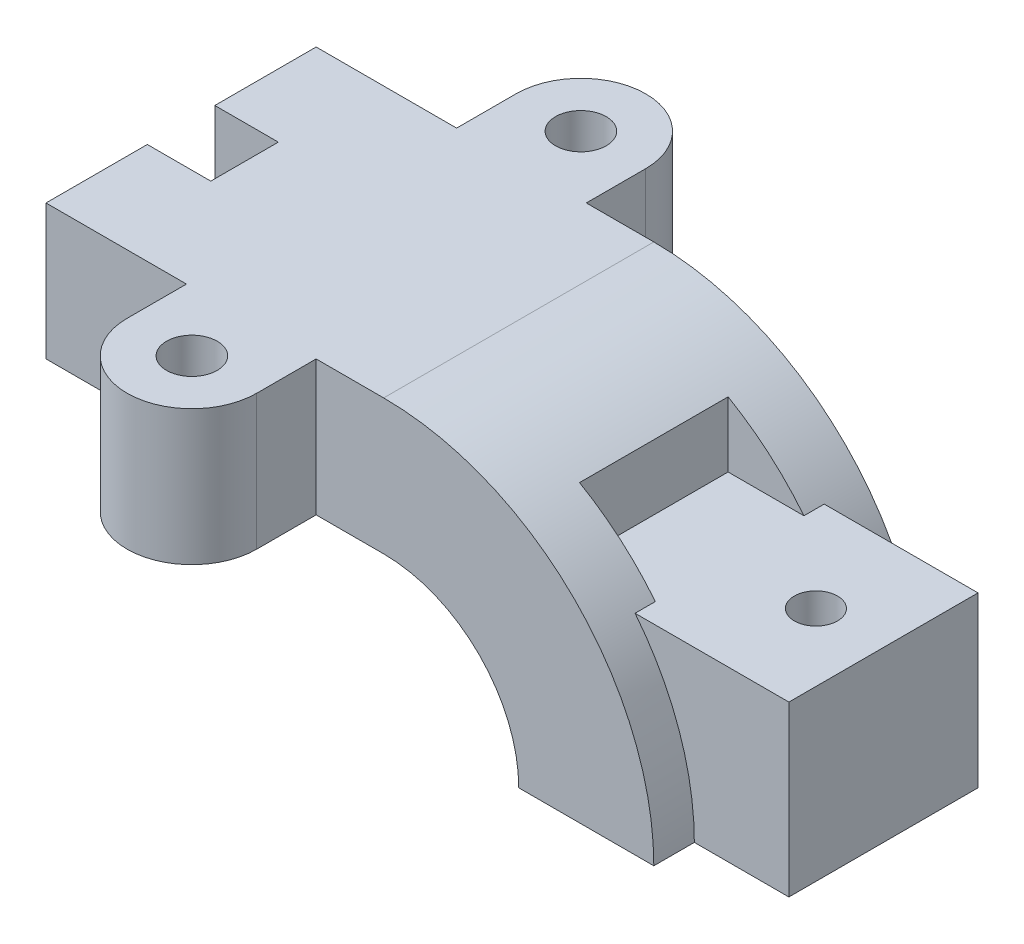
ISO-10303-21;
HEADER;
FILE_DESCRIPTION(('STEP AP214'),'2;1');
FILE_NAME('part.step','',(''),(''),'','','');
FILE_SCHEMA(('AUTOMOTIVE_DESIGN { 1 0 10303 214 1 1 1 1 }'));
ENDSEC;
DATA;
#1=APPLICATION_CONTEXT('core data for automotive mechanical design processes');
#2=APPLICATION_PROTOCOL_DEFINITION('international standard','automotive_design',2000,#1);
#3=PRODUCT_CONTEXT('',#1,'mechanical');
#4=PRODUCT('Part','Part','',(#3));
#5=PRODUCT_RELATED_PRODUCT_CATEGORY('part','',(#4));
#6=PRODUCT_DEFINITION_FORMATION('','',#4);
#7=PRODUCT_DEFINITION_CONTEXT('part definition',#1,'design');
#8=PRODUCT_DEFINITION('design','',#6,#7);
#9=PRODUCT_DEFINITION_SHAPE('','',#8);
#10=(LENGTH_UNIT() NAMED_UNIT(*) SI_UNIT(.MILLI.,.METRE.));
#11=(NAMED_UNIT(*) PLANE_ANGLE_UNIT() SI_UNIT($,.RADIAN.));
#12=(NAMED_UNIT(*) SI_UNIT($,.STERADIAN.) SOLID_ANGLE_UNIT());
#13=UNCERTAINTY_MEASURE_WITH_UNIT(LENGTH_MEASURE(1.E-05),#10,'distance_accuracy_value','');
#14=(GEOMETRIC_REPRESENTATION_CONTEXT(3) GLOBAL_UNCERTAINTY_ASSIGNED_CONTEXT((#13)) GLOBAL_UNIT_ASSIGNED_CONTEXT((#10,
#11,#12)) REPRESENTATION_CONTEXT('',''));
#15=CARTESIAN_POINT('',(0.,0.,0.));
#16=DIRECTION('',(0.,0.,1.));
#17=DIRECTION('',(1.,0.,0.));
#18=AXIS2_PLACEMENT_3D('',#15,#16,#17);
#19=CARTESIAN_POINT('',(0.,0.,-25.4));
#20=DIRECTION('',(0.,0.,-1.));
#21=DIRECTION('',(1.,0.,0.));
#22=AXIS2_PLACEMENT_3D('',#19,#20,#21);
#23=PLANE('',#22);
#24=DIRECTION('',(-1.,0.,0.));
#25=VECTOR('',#24,1.);
#26=CARTESIAN_POINT('',(0.,25.4,-25.4));
#27=LINE('',#26,#25);
#28=CARTESIAN_POINT('',(0.,25.4,-25.4));
#29=VERTEX_POINT('',#28);
#30=CARTESIAN_POINT('',(-12.7,25.4,-25.4));
#31=VERTEX_POINT('',#30);
#32=EDGE_CURVE('E61',#29,#31,#27,.T.);
#33=ORIENTED_EDGE('',*,*,#32,.T.);
#34=DIRECTION('',(0.,1.,0.));
#35=VECTOR('',#34,1.);
#36=CARTESIAN_POINT('',(-12.7,-8.37340492162435,-25.4));
#37=LINE('',#36,#35);
#38=CARTESIAN_POINT('',(-12.7,50.8,-25.4));
#39=VERTEX_POINT('',#38);
#40=EDGE_CURVE('E214',#31,#39,#37,.T.);
#41=ORIENTED_EDGE('',*,*,#40,.T.);
#42=DIRECTION('',(-1.,0.,0.));
#43=VECTOR('',#42,1.);
#44=CARTESIAN_POINT('',(0.,50.8,-25.4));
#45=LINE('',#44,#43);
#46=CARTESIAN_POINT('',(0.,50.8,-25.4));
#47=VERTEX_POINT('',#46);
#48=EDGE_CURVE('E312',#47,#39,#45,.T.);
#49=ORIENTED_EDGE('',*,*,#48,.F.);
#50=CARTESIAN_POINT('',(0.,0.,-25.4));
#51=DIRECTION('',(0.,0.,1.));
#52=DIRECTION('',(1.,0.,0.));
#53=AXIS2_PLACEMENT_3D('',#50,#51,#52);
#54=CIRCLE('',#53,50.8);
#55=CARTESIAN_POINT('',(50.8,0.,-25.4));
#56=VERTEX_POINT('',#55);
#57=EDGE_CURVE('E313',#56,#47,#54,.T.);
#58=ORIENTED_EDGE('',*,*,#57,.F.);
#59=DIRECTION('',(1.,0.,0.));
#60=VECTOR('',#59,1.);
#61=CARTESIAN_POINT('',(0.,0.,-25.4));
#62=LINE('',#61,#60);
#63=CARTESIAN_POINT('',(25.4,0.,-25.4));
#64=VERTEX_POINT('',#63);
#65=EDGE_CURVE('E532',#64,#56,#62,.T.);
#66=ORIENTED_EDGE('',*,*,#65,.F.);
#67=CARTESIAN_POINT('',(0.,0.,-25.4));
#68=DIRECTION('',(0.,0.,1.));
#69=DIRECTION('',(1.,0.,0.));
#70=AXIS2_PLACEMENT_3D('',#67,#68,#69);
#71=CIRCLE('',#70,25.4);
#72=EDGE_CURVE('E303',#64,#29,#71,.T.);
#73=ORIENTED_EDGE('',*,*,#72,.T.);
#74=EDGE_LOOP('',(#33,#41,#49,#58,#66,#73));
#75=FACE_BOUND('',#74,.T.);
#76=ADVANCED_FACE('F36',(#75),#23,.T.);
#77=CARTESIAN_POINT('',(0.,0.,25.4));
#78=DIRECTION('',(0.,0.,1.));
#79=DIRECTION('',(1.,0.,0.));
#80=AXIS2_PLACEMENT_3D('',#77,#78,#79);
#81=PLANE('',#80);
#82=DIRECTION('',(-1.,0.,0.));
#83=VECTOR('',#82,1.);
#84=CARTESIAN_POINT('',(0.,25.4,25.4));
#85=LINE('',#84,#83);
#86=CARTESIAN_POINT('',(-37.084,25.4,25.4));
#87=VERTEX_POINT('',#86);
#88=CARTESIAN_POINT('',(-63.5,25.4,25.4));
#89=VERTEX_POINT('',#88);
#90=EDGE_CURVE('E348',#87,#89,#85,.T.);
#91=ORIENTED_EDGE('',*,*,#90,.F.);
#92=DIRECTION('',(0.,1.,0.));
#93=VECTOR('',#92,1.);
#94=CARTESIAN_POINT('',(-37.084,-8.37340492162435,25.4));
#95=LINE('',#94,#93);
#96=CARTESIAN_POINT('',(-37.084,50.8,25.4));
#97=VERTEX_POINT('',#96);
#98=EDGE_CURVE('E266',#87,#97,#95,.T.);
#99=ORIENTED_EDGE('',*,*,#98,.T.);
#100=DIRECTION('',(-1.,0.,0.));
#101=VECTOR('',#100,1.);
#102=CARTESIAN_POINT('',(0.,50.8,25.4));
#103=LINE('',#102,#101);
#104=CARTESIAN_POINT('',(-63.5,50.8,25.4));
#105=VERTEX_POINT('',#104);
#106=EDGE_CURVE('E277',#97,#105,#103,.T.);
#107=ORIENTED_EDGE('',*,*,#106,.T.);
#108=DIRECTION('',(0.,1.,0.));
#109=VECTOR('',#108,1.);
#110=CARTESIAN_POINT('',(-63.5,0.,25.4));
#111=LINE('',#110,#109);
#112=EDGE_CURVE('E345',#89,#105,#111,.T.);
#113=ORIENTED_EDGE('',*,*,#112,.F.);
#114=EDGE_LOOP('',(#91,#99,#107,#113));
#115=FACE_BOUND('',#114,.T.);
#116=ADVANCED_FACE('F575',(#115),#81,.T.);
#117=CARTESIAN_POINT('',(0.,0.,6.35));
#118=DIRECTION('',(0.,0.,-1.));
#119=DIRECTION('',(-1.,0.,0.));
#120=AXIS2_PLACEMENT_3D('',#117,#118,#119);
#121=CYLINDRICAL_SURFACE('',#120,25.4);
#122=DIRECTION('',(0.,0.,-1.));
#123=VECTOR('',#122,1.);
#124=CARTESIAN_POINT('',(0.,25.4,6.35));
#125=LINE('',#124,#123);
#126=CARTESIAN_POINT('',(0.,25.4,25.4));
#127=VERTEX_POINT('',#126);
#128=EDGE_CURVE('E431',#127,#29,#125,.T.);
#129=ORIENTED_EDGE('',*,*,#128,.T.);
#130=ORIENTED_EDGE('',*,*,#72,.F.);
#131=DIRECTION('',(0.,0.,-1.));
#132=VECTOR('',#131,1.);
#133=CARTESIAN_POINT('',(25.4,0.,6.35));
#134=LINE('',#133,#132);
#135=CARTESIAN_POINT('',(25.4,0.,25.4));
#136=VERTEX_POINT('',#135);
#137=EDGE_CURVE('E11',#136,#64,#134,.T.);
#138=ORIENTED_EDGE('',*,*,#137,.F.);
#139=CARTESIAN_POINT('',(0.,0.,25.4));
#140=DIRECTION('',(0.,0.,1.));
#141=DIRECTION('',(1.,0.,0.));
#142=AXIS2_PLACEMENT_3D('',#139,#140,#141);
#143=CIRCLE('',#142,25.4);
#144=EDGE_CURVE('E352',#136,#127,#143,.T.);
#145=ORIENTED_EDGE('',*,*,#144,.T.);
#146=EDGE_LOOP('',(#129,#130,#138,#145));
#147=FACE_BOUND('',#146,.T.);
#148=ADVANCED_FACE('F38',(#147),#121,.F.);
#149=CARTESIAN_POINT('',(0.,0.,6.35));
#150=DIRECTION('',(0.,1.,0.));
#151=DIRECTION('',(0.,0.,1.));
#152=AXIS2_PLACEMENT_3D('',#149,#150,#151);
#153=PLANE('',#152);
#154=CARTESIAN_POINT('',(55.88,0.,0.));
#155=DIRECTION('',(0.,1.,0.));
#156=DIRECTION('',(0.,0.,1.));
#157=AXIS2_PLACEMENT_3D('',#154,#155,#156);
#158=CIRCLE('',#157,4.064);
#159=CARTESIAN_POINT('',(55.88,0.,4.064));
#160=VERTEX_POINT('',#159);
#161=EDGE_CURVE('E247',#160,#160,#158,.T.);
#162=ORIENTED_EDGE('',*,*,#161,.T.);
#163=EDGE_LOOP('',(#162));
#164=FACE_BOUND('',#163,.T.);
#165=ORIENTED_EDGE('',*,*,#137,.T.);
#166=ORIENTED_EDGE('',*,*,#65,.T.);
#167=DIRECTION('',(0.,0.,1.));
#168=VECTOR('',#167,1.);
#169=CARTESIAN_POINT('',(50.8,0.,-25.4));
#170=LINE('',#169,#168);
#171=CARTESIAN_POINT('',(50.8,0.,-17.78));
#172=VERTEX_POINT('',#171);
#173=EDGE_CURVE('E340',#56,#172,#170,.T.);
#174=ORIENTED_EDGE('',*,*,#173,.T.);
#175=DIRECTION('',(1.,0.,0.));
#176=VECTOR('',#175,1.);
#177=CARTESIAN_POINT('',(0.,0.,-17.78));
#178=LINE('',#177,#176);
#179=CARTESIAN_POINT('',(68.58,0.,-17.78));
#180=VERTEX_POINT('',#179);
#181=EDGE_CURVE('E327',#172,#180,#178,.T.);
#182=ORIENTED_EDGE('',*,*,#181,.T.);
#183=DIRECTION('',(0.,0.,-1.));
#184=VECTOR('',#183,1.);
#185=CARTESIAN_POINT('',(68.58,0.,6.35));
#186=LINE('',#185,#184);
#187=CARTESIAN_POINT('',(68.58,0.,17.78));
#188=VERTEX_POINT('',#187);
#189=EDGE_CURVE('E45',#188,#180,#186,.T.);
#190=ORIENTED_EDGE('',*,*,#189,.F.);
#191=DIRECTION('',(1.,0.,0.));
#192=VECTOR('',#191,1.);
#193=CARTESIAN_POINT('',(0.,0.,17.78));
#194=LINE('',#193,#192);
#195=CARTESIAN_POINT('',(50.8,0.,17.78));
#196=VERTEX_POINT('',#195);
#197=EDGE_CURVE('E373',#196,#188,#194,.T.);
#198=ORIENTED_EDGE('',*,*,#197,.F.);
#199=DIRECTION('',(0.,0.,-1.));
#200=VECTOR('',#199,1.);
#201=CARTESIAN_POINT('',(50.8,0.,25.4));
#202=LINE('',#201,#200);
#203=CARTESIAN_POINT('',(50.8,0.,25.4));
#204=VERTEX_POINT('',#203);
#205=EDGE_CURVE('E362',#204,#196,#202,.T.);
#206=ORIENTED_EDGE('',*,*,#205,.F.);
#207=DIRECTION('',(1.,0.,0.));
#208=VECTOR('',#207,1.);
#209=CARTESIAN_POINT('',(0.,0.,25.4));
#210=LINE('',#209,#208);
#211=EDGE_CURVE('E552',#136,#204,#210,.T.);
#212=ORIENTED_EDGE('',*,*,#211,.F.);
#213=EDGE_LOOP('',(#165,#166,#174,#182,#190,#198,#206,#212));
#214=FACE_BOUND('',#213,.T.);
#215=ADVANCED_FACE('F516',(#164,#214),#153,.F.);
#216=CARTESIAN_POINT('',(68.58,0.,6.35));
#217=DIRECTION('',(-1.,0.,0.));
#218=DIRECTION('',(0.,0.,1.));
#219=AXIS2_PLACEMENT_3D('',#216,#217,#218);
#220=PLANE('',#219);
#221=ORIENTED_EDGE('',*,*,#189,.T.);
#222=DIRECTION('',(0.,1.,0.));
#223=VECTOR('',#222,1.);
#224=CARTESIAN_POINT('',(68.58,0.,-17.78));
#225=LINE('',#224,#223);
#226=CARTESIAN_POINT('',(68.58,31.75,-17.78));
#227=VERTEX_POINT('',#226);
#228=EDGE_CURVE('E324',#180,#227,#225,.T.);
#229=ORIENTED_EDGE('',*,*,#228,.T.);
#230=DIRECTION('',(0.,0.,-1.));
#231=VECTOR('',#230,1.);
#232=CARTESIAN_POINT('',(68.58,31.75,6.35));
#233=LINE('',#232,#231);
#234=CARTESIAN_POINT('',(68.58,31.75,17.78));
#235=VERTEX_POINT('',#234);
#236=EDGE_CURVE('E451',#235,#227,#233,.T.);
#237=ORIENTED_EDGE('',*,*,#236,.F.);
#238=DIRECTION('',(0.,1.,0.));
#239=VECTOR('',#238,1.);
#240=CARTESIAN_POINT('',(68.58,0.,17.78));
#241=LINE('',#240,#239);
#242=EDGE_CURVE('E372',#188,#235,#241,.T.);
#243=ORIENTED_EDGE('',*,*,#242,.F.);
#244=EDGE_LOOP('',(#221,#229,#237,#243));
#245=FACE_BOUND('',#244,.T.);
#246=ADVANCED_FACE('F523',(#245),#220,.F.);
#247=CARTESIAN_POINT('',(0.,31.75,6.35));
#248=DIRECTION('',(0.,-1.,0.));
#249=DIRECTION('',(1.,0.,0.));
#250=AXIS2_PLACEMENT_3D('',#247,#248,#249);
#251=PLANE('',#250);
#252=CARTESIAN_POINT('',(55.88,31.75,0.));
#253=DIRECTION('',(0.,1.,0.));
#254=DIRECTION('',(-1.,0.,0.));
#255=AXIS2_PLACEMENT_3D('',#252,#253,#254);
#256=CIRCLE('',#255,4.064);
#257=CARTESIAN_POINT('',(51.816,31.75,0.));
#258=VERTEX_POINT('',#257);
#259=EDGE_CURVE('E250',#258,#258,#256,.T.);
#260=ORIENTED_EDGE('',*,*,#259,.F.);
#261=EDGE_LOOP('',(#260));
#262=FACE_BOUND('',#261,.T.);
#263=ORIENTED_EDGE('',*,*,#236,.T.);
#264=DIRECTION('',(-1.,0.,0.));
#265=VECTOR('',#264,1.);
#266=CARTESIAN_POINT('',(0.,31.75,-17.78));
#267=LINE('',#266,#265);
#268=CARTESIAN_POINT('',(39.6557372898298,31.75,-17.78));
#269=VERTEX_POINT('',#268);
#270=EDGE_CURVE('E334',#227,#269,#267,.T.);
#271=ORIENTED_EDGE('',*,*,#270,.T.);
#272=DIRECTION('',(0.,0.,1.));
#273=VECTOR('',#272,1.);
#274=CARTESIAN_POINT('',(39.6557372898298,31.75,-17.78));
#275=LINE('',#274,#273);
#276=CARTESIAN_POINT('',(39.6557372898298,31.75,-13.97));
#277=VERTEX_POINT('',#276);
#278=EDGE_CURVE('E337',#269,#277,#275,.T.);
#279=ORIENTED_EDGE('',*,*,#278,.T.);
#280=DIRECTION('',(-1.,0.,0.));
#281=VECTOR('',#280,1.);
#282=CARTESIAN_POINT('',(0.,31.75,-13.97));
#283=LINE('',#282,#281);
#284=CARTESIAN_POINT('',(25.4,31.75,-13.97));
#285=VERTEX_POINT('',#284);
#286=EDGE_CURVE('E465',#277,#285,#283,.T.);
#287=ORIENTED_EDGE('',*,*,#286,.T.);
#288=DIRECTION('',(0.,0.,-1.));
#289=VECTOR('',#288,1.);
#290=CARTESIAN_POINT('',(25.4,31.75,6.35));
#291=LINE('',#290,#289);
#292=CARTESIAN_POINT('',(25.4,31.75,13.97));
#293=VERTEX_POINT('',#292);
#294=EDGE_CURVE('E403',#293,#285,#291,.T.);
#295=ORIENTED_EDGE('',*,*,#294,.F.);
#296=DIRECTION('',(-1.,0.,0.));
#297=VECTOR('',#296,1.);
#298=CARTESIAN_POINT('',(0.,31.75,13.97));
#299=LINE('',#298,#297);
#300=CARTESIAN_POINT('',(39.6557372898298,31.75,13.97));
#301=VERTEX_POINT('',#300);
#302=EDGE_CURVE('E393',#301,#293,#299,.T.);
#303=ORIENTED_EDGE('',*,*,#302,.F.);
#304=DIRECTION('',(0.,0.,-1.));
#305=VECTOR('',#304,1.);
#306=CARTESIAN_POINT('',(39.6557372898298,31.75,17.78));
#307=LINE('',#306,#305);
#308=CARTESIAN_POINT('',(39.6557372898298,31.75,17.78));
#309=VERTEX_POINT('',#308);
#310=EDGE_CURVE('E371',#309,#301,#307,.T.);
#311=ORIENTED_EDGE('',*,*,#310,.F.);
#312=DIRECTION('',(-1.,0.,0.));
#313=VECTOR('',#312,1.);
#314=CARTESIAN_POINT('',(0.,31.75,17.78));
#315=LINE('',#314,#313);
#316=EDGE_CURVE('E369',#235,#309,#315,.T.);
#317=ORIENTED_EDGE('',*,*,#316,.F.);
#318=EDGE_LOOP('',(#263,#271,#279,#287,#295,#303,#311,#317));
#319=FACE_BOUND('',#318,.T.);
#320=ADVANCED_FACE('F469',(#262,#319),#251,.F.);
#321=CARTESIAN_POINT('',(25.4,0.,6.35));
#322=DIRECTION('',(-1.,0.,0.));
#323=DIRECTION('',(0.,0.,1.));
#324=AXIS2_PLACEMENT_3D('',#321,#322,#323);
#325=PLANE('',#324);
#326=ORIENTED_EDGE('',*,*,#294,.T.);
#327=DIRECTION('',(0.,1.,0.));
#328=VECTOR('',#327,1.);
#329=CARTESIAN_POINT('',(25.4,0.,-13.97));
#330=LINE('',#329,#328);
#331=CARTESIAN_POINT('',(25.4,43.9940905122495,-13.97));
#332=VERTEX_POINT('',#331);
#333=EDGE_CURVE('E458',#285,#332,#330,.T.);
#334=ORIENTED_EDGE('',*,*,#333,.T.);
#335=DIRECTION('',(0.,0.,-1.));
#336=VECTOR('',#335,1.);
#337=CARTESIAN_POINT('',(25.4,43.9940905122495,6.35));
#338=LINE('',#337,#336);
#339=CARTESIAN_POINT('',(25.4,43.9940905122495,13.97));
#340=VERTEX_POINT('',#339);
#341=EDGE_CURVE('E401',#340,#332,#338,.T.);
#342=ORIENTED_EDGE('',*,*,#341,.F.);
#343=DIRECTION('',(0.,1.,0.));
#344=VECTOR('',#343,1.);
#345=CARTESIAN_POINT('',(25.4,0.,13.97));
#346=LINE('',#345,#344);
#347=EDGE_CURVE('E397',#293,#340,#346,.T.);
#348=ORIENTED_EDGE('',*,*,#347,.F.);
#349=EDGE_LOOP('',(#326,#334,#342,#348));
#350=FACE_BOUND('',#349,.T.);
#351=ADVANCED_FACE('F457',(#350),#325,.F.);
#352=CARTESIAN_POINT('',(0.,0.,6.35));
#353=DIRECTION('',(0.,0.,-1.));
#354=DIRECTION('',(-1.,0.,0.));
#355=AXIS2_PLACEMENT_3D('',#352,#353,#354);
#356=CYLINDRICAL_SURFACE('',#355,50.8);
#357=ORIENTED_EDGE('',*,*,#341,.T.);
#358=CARTESIAN_POINT('',(0.,0.,-13.97));
#359=DIRECTION('',(0.,0.,1.));
#360=DIRECTION('',(1.,0.,0.));
#361=AXIS2_PLACEMENT_3D('',#358,#359,#360);
#362=CIRCLE('',#361,50.8);
#363=EDGE_CURVE('E331',#277,#332,#362,.T.);
#364=ORIENTED_EDGE('',*,*,#363,.F.);
#365=ORIENTED_EDGE('',*,*,#278,.F.);
#366=CARTESIAN_POINT('',(0.,0.,-17.78));
#367=DIRECTION('',(0.,0.,1.));
#368=DIRECTION('',(1.,0.,0.));
#369=AXIS2_PLACEMENT_3D('',#366,#367,#368);
#370=CIRCLE('',#369,50.8);
#371=EDGE_CURVE('E276',#172,#269,#370,.T.);
#372=ORIENTED_EDGE('',*,*,#371,.F.);
#373=ORIENTED_EDGE('',*,*,#173,.F.);
#374=ORIENTED_EDGE('',*,*,#57,.T.);
#375=DIRECTION('',(0.,0.,-1.));
#376=VECTOR('',#375,1.);
#377=CARTESIAN_POINT('',(0.,50.8,6.35));
#378=LINE('',#377,#376);
#379=CARTESIAN_POINT('',(0.,50.8,25.4));
#380=VERTEX_POINT('',#379);
#381=EDGE_CURVE('E404',#380,#47,#378,.T.);
#382=ORIENTED_EDGE('',*,*,#381,.F.);
#383=CARTESIAN_POINT('',(0.,0.,25.4));
#384=DIRECTION('',(0.,0.,1.));
#385=DIRECTION('',(1.,0.,0.));
#386=AXIS2_PLACEMENT_3D('',#383,#384,#385);
#387=CIRCLE('',#386,50.8);
#388=EDGE_CURVE('E547',#204,#380,#387,.T.);
#389=ORIENTED_EDGE('',*,*,#388,.F.);
#390=ORIENTED_EDGE('',*,*,#205,.T.);
#391=CARTESIAN_POINT('',(0.,0.,17.78));
#392=DIRECTION('',(0.,0.,1.));
#393=DIRECTION('',(1.,0.,0.));
#394=AXIS2_PLACEMENT_3D('',#391,#392,#393);
#395=CIRCLE('',#394,50.8);
#396=EDGE_CURVE('E349',#196,#309,#395,.T.);
#397=ORIENTED_EDGE('',*,*,#396,.T.);
#398=ORIENTED_EDGE('',*,*,#310,.T.);
#399=CARTESIAN_POINT('',(0.,0.,13.97));
#400=DIRECTION('',(0.,0.,1.));
#401=DIRECTION('',(1.,0.,0.));
#402=AXIS2_PLACEMENT_3D('',#399,#400,#401);
#403=CIRCLE('',#402,50.8);
#404=EDGE_CURVE('E365',#301,#340,#403,.T.);
#405=ORIENTED_EDGE('',*,*,#404,.T.);
#406=EDGE_LOOP('',(#357,#364,#365,#372,#373,#374,#382,#389,#390,#397,#398,#405));
#407=FACE_BOUND('',#406,.T.);
#408=ADVANCED_FACE('F507',(#407),#356,.T.);
#409=CARTESIAN_POINT('',(0.,50.8,6.35));
#410=DIRECTION('',(0.,-1.,0.));
#411=DIRECTION('',(1.,0.,0.));
#412=AXIS2_PLACEMENT_3D('',#409,#410,#411);
#413=PLANE('',#412);
#414=ORIENTED_EDGE('',*,*,#381,.T.);
#415=ORIENTED_EDGE('',*,*,#48,.T.);
#416=DIRECTION('',(0.,0.,1.));
#417=VECTOR('',#416,1.);
#418=CARTESIAN_POINT('',(-12.7,50.8,0.));
#419=LINE('',#418,#417);
#420=CARTESIAN_POINT('',(-12.7,50.8,-36.576));
#421=VERTEX_POINT('',#420);
#422=EDGE_CURVE('E240',#421,#39,#419,.T.);
#423=ORIENTED_EDGE('',*,*,#422,.F.);
#424=CARTESIAN_POINT('',(-24.892,50.8,-36.576));
#425=DIRECTION('',(0.,1.,0.));
#426=DIRECTION('',(-1.,0.,0.));
#427=AXIS2_PLACEMENT_3D('',#424,#425,#426);
#428=CIRCLE('',#427,12.192);
#429=CARTESIAN_POINT('',(-37.084,50.8,-36.576));
#430=VERTEX_POINT('',#429);
#431=EDGE_CURVE('E979',#421,#430,#428,.T.);
#432=ORIENTED_EDGE('',*,*,#431,.T.);
#433=DIRECTION('',(0.,0.,1.));
#434=VECTOR('',#433,1.);
#435=CARTESIAN_POINT('',(-37.084,50.8,0.));
#436=LINE('',#435,#434);
#437=CARTESIAN_POINT('',(-37.084,50.8,-25.4));
#438=VERTEX_POINT('',#437);
#439=EDGE_CURVE('E220',#430,#438,#436,.T.);
#440=ORIENTED_EDGE('',*,*,#439,.T.);
#441=CARTESIAN_POINT('',(-63.5,50.8,-25.4));
#442=VERTEX_POINT('',#441);
#443=EDGE_CURVE('E309',#438,#442,#45,.T.);
#444=ORIENTED_EDGE('',*,*,#443,.T.);
#445=DIRECTION('',(0.,0.,1.));
#446=VECTOR('',#445,1.);
#447=CARTESIAN_POINT('',(-63.5,50.8,-13.97));
#448=LINE('',#447,#446);
#449=CARTESIAN_POINT('',(-63.5,50.8,-6.35));
#450=VERTEX_POINT('',#449);
#451=EDGE_CURVE('E467',#442,#450,#448,.T.);
#452=ORIENTED_EDGE('',*,*,#451,.T.);
#453=DIRECTION('',(-1.,0.,0.));
#454=VECTOR('',#453,1.);
#455=CARTESIAN_POINT('',(0.,50.8,-6.35));
#456=LINE('',#455,#454);
#457=CARTESIAN_POINT('',(-51.562,50.8,-6.35));
#458=VERTEX_POINT('',#457);
#459=EDGE_CURVE('E471',#458,#450,#456,.T.);
#460=ORIENTED_EDGE('',*,*,#459,.F.);
#461=DIRECTION('',(0.,0.,-1.));
#462=VECTOR('',#461,1.);
#463=CARTESIAN_POINT('',(-51.562,50.8,6.35));
#464=LINE('',#463,#462);
#465=CARTESIAN_POINT('',(-51.562,50.8,6.35));
#466=VERTEX_POINT('',#465);
#467=EDGE_CURVE('E440',#466,#458,#464,.T.);
#468=ORIENTED_EDGE('',*,*,#467,.F.);
#469=DIRECTION('',(-1.,0.,0.));
#470=VECTOR('',#469,1.);
#471=CARTESIAN_POINT('',(0.,50.8,6.35));
#472=LINE('',#471,#470);
#473=CARTESIAN_POINT('',(-63.5,50.8,6.35));
#474=VERTEX_POINT('',#473);
#475=EDGE_CURVE('E398',#466,#474,#472,.T.);
#476=ORIENTED_EDGE('',*,*,#475,.T.);
#477=DIRECTION('',(0.,0.,-1.));
#478=VECTOR('',#477,1.);
#479=CARTESIAN_POINT('',(-63.5,50.8,13.97));
#480=LINE('',#479,#478);
#481=EDGE_CURVE('E408',#105,#474,#480,.T.);
#482=ORIENTED_EDGE('',*,*,#481,.F.);
#483=ORIENTED_EDGE('',*,*,#106,.F.);
#484=DIRECTION('',(0.,0.,-1.));
#485=VECTOR('',#484,1.);
#486=CARTESIAN_POINT('',(-37.084,50.8,0.));
#487=LINE('',#486,#485);
#488=CARTESIAN_POINT('',(-37.084,50.8,36.576));
#489=VERTEX_POINT('',#488);
#490=EDGE_CURVE('E262',#489,#97,#487,.T.);
#491=ORIENTED_EDGE('',*,*,#490,.F.);
#492=CARTESIAN_POINT('',(-24.892,50.8,36.576));
#493=DIRECTION('',(0.,1.,0.));
#494=DIRECTION('',(-1.,0.,0.));
#495=AXIS2_PLACEMENT_3D('',#492,#493,#494);
#496=CIRCLE('',#495,12.192);
#497=CARTESIAN_POINT('',(-12.7,50.8,36.576));
#498=VERTEX_POINT('',#497);
#499=EDGE_CURVE('E258',#498,#489,#496,.F.);
#500=ORIENTED_EDGE('',*,*,#499,.F.);
#501=DIRECTION('',(0.,0.,-1.));
#502=VECTOR('',#501,1.);
#503=CARTESIAN_POINT('',(-12.7,50.8,0.));
#504=LINE('',#503,#502);
#505=CARTESIAN_POINT('',(-12.7,50.8,25.4));
#506=VERTEX_POINT('',#505);
#507=EDGE_CURVE('E261',#498,#506,#504,.T.);
#508=ORIENTED_EDGE('',*,*,#507,.T.);
#509=EDGE_CURVE('E366',#380,#506,#103,.T.);
#510=ORIENTED_EDGE('',*,*,#509,.F.);
#511=EDGE_LOOP('',(#414,#415,#423,#432,#440,#444,#452,#460,#468,#476,#482,#483,#491,#500,#508,#510));
#512=FACE_BOUND('',#511,.T.);
#513=CARTESIAN_POINT('',(-24.892,50.8,36.576));
#514=DIRECTION('',(0.,1.,0.));
#515=DIRECTION('',(-1.,0.,0.));
#516=AXIS2_PLACEMENT_3D('',#513,#514,#515);
#517=CIRCLE('',#516,4.7625);
#518=CARTESIAN_POINT('',(-29.6545,50.8,36.576));
#519=VERTEX_POINT('',#518);
#520=EDGE_CURVE('E263',#519,#519,#517,.F.);
#521=ORIENTED_EDGE('',*,*,#520,.T.);
#522=EDGE_LOOP('',(#521));
#523=FACE_BOUND('',#522,.T.);
#524=CARTESIAN_POINT('',(-24.892,50.8,-36.576));
#525=DIRECTION('',(0.,1.,0.));
#526=DIRECTION('',(-1.,0.,0.));
#527=AXIS2_PLACEMENT_3D('',#524,#525,#526);
#528=CIRCLE('',#527,4.7625);
#529=CARTESIAN_POINT('',(-29.6545,50.8,-36.576));
#530=VERTEX_POINT('',#529);
#531=EDGE_CURVE('E224',#530,#530,#528,.T.);
#532=ORIENTED_EDGE('',*,*,#531,.F.);
#533=EDGE_LOOP('',(#532));
#534=FACE_BOUND('',#533,.T.);
#535=ADVANCED_FACE('F500',(#512,#523,#534),#413,.F.);
#536=CARTESIAN_POINT('',(-51.562,0.,6.35));
#537=DIRECTION('',(1.,0.,0.));
#538=DIRECTION('',(0.,0.,-1.));
#539=AXIS2_PLACEMENT_3D('',#536,#537,#538);
#540=PLANE('',#539);
#541=ORIENTED_EDGE('',*,*,#467,.T.);
#542=DIRECTION('',(0.,-1.,0.));
#543=VECTOR('',#542,1.);
#544=CARTESIAN_POINT('',(-51.562,0.,-6.35));
#545=LINE('',#544,#543);
#546=CARTESIAN_POINT('',(-51.562,25.4,-6.35));
#547=VERTEX_POINT('',#546);
#548=EDGE_CURVE('E478',#458,#547,#545,.T.);
#549=ORIENTED_EDGE('',*,*,#548,.T.);
#550=DIRECTION('',(0.,0.,-1.));
#551=VECTOR('',#550,1.);
#552=CARTESIAN_POINT('',(-51.562,25.4,6.35));
#553=LINE('',#552,#551);
#554=CARTESIAN_POINT('',(-51.562,25.4,6.35));
#555=VERTEX_POINT('',#554);
#556=EDGE_CURVE('E441',#555,#547,#553,.T.);
#557=ORIENTED_EDGE('',*,*,#556,.F.);
#558=DIRECTION('',(0.,-1.,0.));
#559=VECTOR('',#558,1.);
#560=CARTESIAN_POINT('',(-51.562,0.,6.35));
#561=LINE('',#560,#559);
#562=EDGE_CURVE('E434',#466,#555,#561,.T.);
#563=ORIENTED_EDGE('',*,*,#562,.F.);
#564=EDGE_LOOP('',(#541,#549,#557,#563));
#565=FACE_BOUND('',#564,.T.);
#566=ADVANCED_FACE('F669',(#565),#540,.F.);
#567=CARTESIAN_POINT('',(0.,25.4,6.35));
#568=DIRECTION('',(0.,-1.,0.));
#569=DIRECTION('',(1.,0.,0.));
#570=AXIS2_PLACEMENT_3D('',#567,#568,#569);
#571=PLANE('',#570);
#572=ORIENTED_EDGE('',*,*,#556,.T.);
#573=DIRECTION('',(-1.,0.,0.));
#574=VECTOR('',#573,1.);
#575=CARTESIAN_POINT('',(0.,25.4,-6.35));
#576=LINE('',#575,#574);
#577=CARTESIAN_POINT('',(-63.5,25.4,-6.35));
#578=VERTEX_POINT('',#577);
#579=EDGE_CURVE('E474',#547,#578,#576,.T.);
#580=ORIENTED_EDGE('',*,*,#579,.T.);
#581=DIRECTION('',(0.,0.,1.));
#582=VECTOR('',#581,1.);
#583=CARTESIAN_POINT('',(-63.5,25.4,-13.97));
#584=LINE('',#583,#582);
#585=CARTESIAN_POINT('',(-63.5,25.4,-25.4));
#586=VERTEX_POINT('',#585);
#587=EDGE_CURVE('E494',#586,#578,#584,.T.);
#588=ORIENTED_EDGE('',*,*,#587,.F.);
#589=CARTESIAN_POINT('',(-37.084,25.4,-25.4));
#590=VERTEX_POINT('',#589);
#591=EDGE_CURVE('E212',#590,#586,#27,.T.);
#592=ORIENTED_EDGE('',*,*,#591,.F.);
#593=DIRECTION('',(0.,0.,1.));
#594=VECTOR('',#593,1.);
#595=CARTESIAN_POINT('',(-37.084,25.4,0.));
#596=LINE('',#595,#594);
#597=CARTESIAN_POINT('',(-37.084,25.4,-36.576));
#598=VERTEX_POINT('',#597);
#599=EDGE_CURVE('E204',#598,#590,#596,.T.);
#600=ORIENTED_EDGE('',*,*,#599,.F.);
#601=CARTESIAN_POINT('',(-24.892,25.4,-36.576));
#602=DIRECTION('',(0.,-1.,0.));
#603=DIRECTION('',(1.,0.,0.));
#604=AXIS2_PLACEMENT_3D('',#601,#602,#603);
#605=CIRCLE('',#604,12.192);
#606=CARTESIAN_POINT('',(-12.7,25.4,-36.576));
#607=VERTEX_POINT('',#606);
#608=EDGE_CURVE('E209',#607,#598,#605,.F.);
#609=ORIENTED_EDGE('',*,*,#608,.F.);
#610=DIRECTION('',(0.,0.,1.));
#611=VECTOR('',#610,1.);
#612=CARTESIAN_POINT('',(-12.7,25.4,0.));
#613=LINE('',#612,#611);
#614=EDGE_CURVE('E297',#607,#31,#613,.T.);
#615=ORIENTED_EDGE('',*,*,#614,.T.);
#616=ORIENTED_EDGE('',*,*,#32,.F.);
#617=ORIENTED_EDGE('',*,*,#128,.F.);
#618=CARTESIAN_POINT('',(-12.7,25.4,25.4));
#619=VERTEX_POINT('',#618);
#620=EDGE_CURVE('E357',#127,#619,#85,.T.);
#621=ORIENTED_EDGE('',*,*,#620,.T.);
#622=DIRECTION('',(0.,0.,-1.));
#623=VECTOR('',#622,1.);
#624=CARTESIAN_POINT('',(-12.7,25.4,0.));
#625=LINE('',#624,#623);
#626=CARTESIAN_POINT('',(-12.7,25.4,36.576));
#627=VERTEX_POINT('',#626);
#628=EDGE_CURVE('E256',#627,#619,#625,.T.);
#629=ORIENTED_EDGE('',*,*,#628,.F.);
#630=CARTESIAN_POINT('',(-24.892,25.4,36.576));
#631=DIRECTION('',(0.,-1.,0.));
#632=DIRECTION('',(1.,0.,0.));
#633=AXIS2_PLACEMENT_3D('',#630,#631,#632);
#634=CIRCLE('',#633,12.192);
#635=CARTESIAN_POINT('',(-37.084,25.4,36.576));
#636=VERTEX_POINT('',#635);
#637=EDGE_CURVE('E253',#627,#636,#634,.T.);
#638=ORIENTED_EDGE('',*,*,#637,.T.);
#639=DIRECTION('',(0.,0.,-1.));
#640=VECTOR('',#639,1.);
#641=CARTESIAN_POINT('',(-37.084,25.4,0.));
#642=LINE('',#641,#640);
#643=EDGE_CURVE('E257',#636,#87,#642,.T.);
#644=ORIENTED_EDGE('',*,*,#643,.T.);
#645=ORIENTED_EDGE('',*,*,#90,.T.);
#646=DIRECTION('',(0.,0.,-1.));
#647=VECTOR('',#646,1.);
#648=CARTESIAN_POINT('',(-63.5,25.4,13.97));
#649=LINE('',#648,#647);
#650=CARTESIAN_POINT('',(-63.5,25.4,6.35));
#651=VERTEX_POINT('',#650);
#652=EDGE_CURVE('E437',#89,#651,#649,.T.);
#653=ORIENTED_EDGE('',*,*,#652,.T.);
#654=DIRECTION('',(-1.,0.,0.));
#655=VECTOR('',#654,1.);
#656=CARTESIAN_POINT('',(0.,25.4,6.35));
#657=LINE('',#656,#655);
#658=EDGE_CURVE('E416',#555,#651,#657,.T.);
#659=ORIENTED_EDGE('',*,*,#658,.F.);
#660=EDGE_LOOP('',(#572,#580,#588,#592,#600,#609,#615,#616,#617,#621,#629,#638,#644,#645,#653,#659));
#661=FACE_BOUND('',#660,.T.);
#662=CARTESIAN_POINT('',(-24.892,25.4,36.576));
#663=DIRECTION('',(0.,-1.,0.));
#664=DIRECTION('',(1.,0.,0.));
#665=AXIS2_PLACEMENT_3D('',#662,#663,#664);
#666=CIRCLE('',#665,4.7625);
#667=CARTESIAN_POINT('',(-20.1295,25.4,36.576));
#668=VERTEX_POINT('',#667);
#669=EDGE_CURVE('E294',#668,#668,#666,.T.);
#670=ORIENTED_EDGE('',*,*,#669,.F.);
#671=EDGE_LOOP('',(#670));
#672=FACE_BOUND('',#671,.T.);
#673=CARTESIAN_POINT('',(-24.892,25.4,-36.576));
#674=DIRECTION('',(0.,-1.,0.));
#675=DIRECTION('',(1.,0.,0.));
#676=AXIS2_PLACEMENT_3D('',#673,#674,#675);
#677=CIRCLE('',#676,4.7625);
#678=CARTESIAN_POINT('',(-20.1295,25.4,-36.576));
#679=VERTEX_POINT('',#678);
#680=EDGE_CURVE('E233',#679,#679,#677,.F.);
#681=ORIENTED_EDGE('',*,*,#680,.T.);
#682=EDGE_LOOP('',(#681));
#683=FACE_BOUND('',#682,.T.);
#684=ADVANCED_FACE('F206',(#661,#672,#683),#571,.T.);
#685=CARTESIAN_POINT('',(0.,0.,6.35));
#686=DIRECTION('',(0.,0.,1.));
#687=DIRECTION('',(1.,0.,0.));
#688=AXIS2_PLACEMENT_3D('',#685,#686,#687);
#689=PLANE('',#688);
#690=ORIENTED_EDGE('',*,*,#475,.F.);
#691=ORIENTED_EDGE('',*,*,#562,.T.);
#692=ORIENTED_EDGE('',*,*,#658,.T.);
#693=DIRECTION('',(0.,1.,0.));
#694=VECTOR('',#693,1.);
#695=CARTESIAN_POINT('',(-63.5,0.,6.35));
#696=LINE('',#695,#694);
#697=EDGE_CURVE('E410',#651,#474,#696,.T.);
#698=ORIENTED_EDGE('',*,*,#697,.T.);
#699=EDGE_LOOP('',(#690,#691,#692,#698));
#700=FACE_BOUND('',#699,.T.);
#701=ADVANCED_FACE('F581',(#700),#689,.F.);
#702=CARTESIAN_POINT('',(-63.5,0.,13.97));
#703=DIRECTION('',(-1.,0.,0.));
#704=DIRECTION('',(0.,0.,1.));
#705=AXIS2_PLACEMENT_3D('',#702,#703,#704);
#706=PLANE('',#705);
#707=ORIENTED_EDGE('',*,*,#697,.F.);
#708=ORIENTED_EDGE('',*,*,#652,.F.);
#709=ORIENTED_EDGE('',*,*,#112,.T.);
#710=ORIENTED_EDGE('',*,*,#481,.T.);
#711=EDGE_LOOP('',(#707,#708,#709,#710));
#712=FACE_BOUND('',#711,.T.);
#713=ADVANCED_FACE('F579',(#712),#706,.T.);
#714=CARTESIAN_POINT('',(0.,0.,13.97));
#715=DIRECTION('',(0.,0.,1.));
#716=DIRECTION('',(1.,0.,0.));
#717=AXIS2_PLACEMENT_3D('',#714,#715,#716);
#718=PLANE('',#717);
#719=ORIENTED_EDGE('',*,*,#404,.F.);
#720=ORIENTED_EDGE('',*,*,#302,.T.);
#721=ORIENTED_EDGE('',*,*,#347,.T.);
#722=EDGE_LOOP('',(#719,#720,#721));
#723=FACE_BOUND('',#722,.T.);
#724=ADVANCED_FACE('F526',(#723),#718,.F.);
#725=CARTESIAN_POINT('',(0.,0.,17.78));
#726=DIRECTION('',(0.,0.,1.));
#727=DIRECTION('',(1.,0.,0.));
#728=AXIS2_PLACEMENT_3D('',#725,#726,#727);
#729=PLANE('',#728);
#730=ORIENTED_EDGE('',*,*,#396,.F.);
#731=ORIENTED_EDGE('',*,*,#197,.T.);
#732=ORIENTED_EDGE('',*,*,#242,.T.);
#733=ORIENTED_EDGE('',*,*,#316,.T.);
#734=EDGE_LOOP('',(#730,#731,#732,#733));
#735=FACE_BOUND('',#734,.T.);
#736=ADVANCED_FACE('F512',(#735),#729,.T.);
#737=DIRECTION('',(0.,1.,0.));
#738=VECTOR('',#737,1.);
#739=CARTESIAN_POINT('',(-12.7,-8.37340492162435,25.4));
#740=LINE('',#739,#738);
#741=EDGE_CURVE('E272',#619,#506,#740,.T.);
#742=ORIENTED_EDGE('',*,*,#741,.F.);
#743=ORIENTED_EDGE('',*,*,#620,.F.);
#744=ORIENTED_EDGE('',*,*,#144,.F.);
#745=ORIENTED_EDGE('',*,*,#211,.T.);
#746=ORIENTED_EDGE('',*,*,#388,.T.);
#747=ORIENTED_EDGE('',*,*,#509,.T.);
#748=EDGE_LOOP('',(#742,#743,#744,#745,#746,#747));
#749=FACE_BOUND('',#748,.T.);
#750=ADVANCED_FACE('F553',(#749),#81,.T.);
#751=CARTESIAN_POINT('',(0.,0.,-6.35));
#752=DIRECTION('',(0.,0.,-1.));
#753=DIRECTION('',(1.,0.,0.));
#754=AXIS2_PLACEMENT_3D('',#751,#752,#753);
#755=PLANE('',#754);
#756=ORIENTED_EDGE('',*,*,#459,.T.);
#757=DIRECTION('',(0.,1.,0.));
#758=VECTOR('',#757,1.);
#759=CARTESIAN_POINT('',(-63.5,0.,-6.35));
#760=LINE('',#759,#758);
#761=EDGE_CURVE('E485',#578,#450,#760,.T.);
#762=ORIENTED_EDGE('',*,*,#761,.F.);
#763=ORIENTED_EDGE('',*,*,#579,.F.);
#764=ORIENTED_EDGE('',*,*,#548,.F.);
#765=EDGE_LOOP('',(#756,#762,#763,#764));
#766=FACE_BOUND('',#765,.T.);
#767=ADVANCED_FACE('F506',(#766),#755,.F.);
#768=CARTESIAN_POINT('',(-63.5,0.,-13.97));
#769=DIRECTION('',(-1.,0.,0.));
#770=DIRECTION('',(0.,0.,-1.));
#771=AXIS2_PLACEMENT_3D('',#768,#769,#770);
#772=PLANE('',#771);
#773=ORIENTED_EDGE('',*,*,#761,.T.);
#774=ORIENTED_EDGE('',*,*,#451,.F.);
#775=DIRECTION('',(0.,1.,0.));
#776=VECTOR('',#775,1.);
#777=CARTESIAN_POINT('',(-63.5,0.,-25.4));
#778=LINE('',#777,#776);
#779=EDGE_CURVE('E298',#586,#442,#778,.T.);
#780=ORIENTED_EDGE('',*,*,#779,.F.);
#781=ORIENTED_EDGE('',*,*,#587,.T.);
#782=EDGE_LOOP('',(#773,#774,#780,#781));
#783=FACE_BOUND('',#782,.T.);
#784=ADVANCED_FACE('F504',(#783),#772,.T.);
#785=CARTESIAN_POINT('',(0.,0.,-13.97));
#786=DIRECTION('',(0.,0.,-1.));
#787=DIRECTION('',(1.,0.,0.));
#788=AXIS2_PLACEMENT_3D('',#785,#786,#787);
#789=PLANE('',#788);
#790=ORIENTED_EDGE('',*,*,#363,.T.);
#791=ORIENTED_EDGE('',*,*,#333,.F.);
#792=ORIENTED_EDGE('',*,*,#286,.F.);
#793=EDGE_LOOP('',(#790,#791,#792));
#794=FACE_BOUND('',#793,.T.);
#795=ADVANCED_FACE('F464',(#794),#789,.F.);
#796=CARTESIAN_POINT('',(0.,0.,-17.78));
#797=DIRECTION('',(0.,0.,-1.));
#798=DIRECTION('',(1.,0.,0.));
#799=AXIS2_PLACEMENT_3D('',#796,#797,#798);
#800=PLANE('',#799);
#801=ORIENTED_EDGE('',*,*,#371,.T.);
#802=ORIENTED_EDGE('',*,*,#270,.F.);
#803=ORIENTED_EDGE('',*,*,#228,.F.);
#804=ORIENTED_EDGE('',*,*,#181,.F.);
#805=EDGE_LOOP('',(#801,#802,#803,#804));
#806=FACE_BOUND('',#805,.T.);
#807=ADVANCED_FACE('F529',(#806),#800,.T.);
#808=DIRECTION('',(0.,1.,0.));
#809=VECTOR('',#808,1.);
#810=CARTESIAN_POINT('',(-37.084,-8.37340492162435,-25.4));
#811=LINE('',#810,#809);
#812=EDGE_CURVE('E53',#590,#438,#811,.T.);
#813=ORIENTED_EDGE('',*,*,#812,.F.);
#814=ORIENTED_EDGE('',*,*,#591,.T.);
#815=ORIENTED_EDGE('',*,*,#779,.T.);
#816=ORIENTED_EDGE('',*,*,#443,.F.);
#817=EDGE_LOOP('',(#813,#814,#815,#816));
#818=FACE_BOUND('',#817,.T.);
#819=ADVANCED_FACE('F592',(#818),#23,.T.);
#820=CARTESIAN_POINT('',(-37.084,-8.37340492162435,0.));
#821=DIRECTION('',(1.,0.,0.));
#822=DIRECTION('',(0.,1.,0.));
#823=AXIS2_PLACEMENT_3D('',#820,#821,#822);
#824=PLANE('',#823);
#825=ORIENTED_EDGE('',*,*,#643,.F.);
#826=DIRECTION('',(0.,1.,0.));
#827=VECTOR('',#826,1.);
#828=CARTESIAN_POINT('',(-37.084,-8.37340492162435,36.576));
#829=LINE('',#828,#827);
#830=EDGE_CURVE('E290',#636,#489,#829,.T.);
#831=ORIENTED_EDGE('',*,*,#830,.T.);
#832=ORIENTED_EDGE('',*,*,#490,.T.);
#833=ORIENTED_EDGE('',*,*,#98,.F.);
#834=EDGE_LOOP('',(#825,#831,#832,#833));
#835=FACE_BOUND('',#834,.T.);
#836=ADVANCED_FACE('F562',(#835),#824,.F.);
#837=CARTESIAN_POINT('',(-24.892,-8.37340492162435,36.576));
#838=DIRECTION('',(0.,1.,0.));
#839=DIRECTION('',(-1.,0.,0.));
#840=AXIS2_PLACEMENT_3D('',#837,#838,#839);
#841=CYLINDRICAL_SURFACE('',#840,12.192);
#842=ORIENTED_EDGE('',*,*,#637,.F.);
#843=DIRECTION('',(0.,1.,0.));
#844=VECTOR('',#843,1.);
#845=CARTESIAN_POINT('',(-12.7,-8.37340492162435,36.576));
#846=LINE('',#845,#844);
#847=EDGE_CURVE('E269',#627,#498,#846,.T.);
#848=ORIENTED_EDGE('',*,*,#847,.T.);
#849=ORIENTED_EDGE('',*,*,#499,.T.);
#850=ORIENTED_EDGE('',*,*,#830,.F.);
#851=EDGE_LOOP('',(#842,#848,#849,#850));
#852=FACE_BOUND('',#851,.T.);
#853=ADVANCED_FACE('F566',(#852),#841,.T.);
#854=CARTESIAN_POINT('',(-12.7,-8.37340492162435,0.));
#855=DIRECTION('',(1.,0.,0.));
#856=DIRECTION('',(0.,1.,0.));
#857=AXIS2_PLACEMENT_3D('',#854,#855,#856);
#858=PLANE('',#857);
#859=ORIENTED_EDGE('',*,*,#847,.F.);
#860=ORIENTED_EDGE('',*,*,#628,.T.);
#861=ORIENTED_EDGE('',*,*,#741,.T.);
#862=ORIENTED_EDGE('',*,*,#507,.F.);
#863=EDGE_LOOP('',(#859,#860,#861,#862));
#864=FACE_BOUND('',#863,.T.);
#865=ADVANCED_FACE('F557',(#864),#858,.T.);
#866=CARTESIAN_POINT('',(-24.892,-8.37340492162435,36.576));
#867=DIRECTION('',(0.,1.,0.));
#868=DIRECTION('',(-1.,0.,0.));
#869=AXIS2_PLACEMENT_3D('',#866,#867,#868);
#870=CYLINDRICAL_SURFACE('',#869,4.7625);
#871=ORIENTED_EDGE('',*,*,#520,.F.);
#872=EDGE_LOOP('',(#871));
#873=FACE_BOUND('',#872,.T.);
#874=ORIENTED_EDGE('',*,*,#669,.T.);
#875=EDGE_LOOP('',(#874));
#876=FACE_BOUND('',#875,.T.);
#877=ADVANCED_FACE('F899',(#873,#876),#870,.F.);
#878=CARTESIAN_POINT('',(-12.7,-8.37340492162435,0.));
#879=DIRECTION('',(-1.,0.,0.));
#880=DIRECTION('',(0.,-1.,0.));
#881=AXIS2_PLACEMENT_3D('',#878,#879,#880);
#882=PLANE('',#881);
#883=ORIENTED_EDGE('',*,*,#614,.F.);
#884=DIRECTION('',(0.,1.,0.));
#885=VECTOR('',#884,1.);
#886=CARTESIAN_POINT('',(-12.7,-8.37340492162435,-36.576));
#887=LINE('',#886,#885);
#888=EDGE_CURVE('E228',#607,#421,#887,.T.);
#889=ORIENTED_EDGE('',*,*,#888,.T.);
#890=ORIENTED_EDGE('',*,*,#422,.T.);
#891=ORIENTED_EDGE('',*,*,#40,.F.);
#892=EDGE_LOOP('',(#883,#889,#890,#891));
#893=FACE_BOUND('',#892,.T.);
#894=ADVANCED_FACE('F541',(#893),#882,.F.);
#895=CARTESIAN_POINT('',(-37.084,-8.37340492162435,0.));
#896=DIRECTION('',(-1.,0.,0.));
#897=DIRECTION('',(0.,-1.,0.));
#898=AXIS2_PLACEMENT_3D('',#895,#896,#897);
#899=PLANE('',#898);
#900=DIRECTION('',(0.,1.,0.));
#901=VECTOR('',#900,1.);
#902=CARTESIAN_POINT('',(-37.084,-8.37340492162435,-36.576));
#903=LINE('',#902,#901);
#904=EDGE_CURVE('E217',#598,#430,#903,.T.);
#905=ORIENTED_EDGE('',*,*,#904,.F.);
#906=ORIENTED_EDGE('',*,*,#599,.T.);
#907=ORIENTED_EDGE('',*,*,#812,.T.);
#908=ORIENTED_EDGE('',*,*,#439,.F.);
#909=EDGE_LOOP('',(#905,#906,#907,#908));
#910=FACE_BOUND('',#909,.T.);
#911=ADVANCED_FACE('F218',(#910),#899,.T.);
#912=CARTESIAN_POINT('',(-24.892,-8.37340492162435,-36.576));
#913=DIRECTION('',(0.,1.,0.));
#914=DIRECTION('',(-1.,0.,0.));
#915=AXIS2_PLACEMENT_3D('',#912,#913,#914);
#916=CYLINDRICAL_SURFACE('',#915,12.192);
#917=ORIENTED_EDGE('',*,*,#888,.F.);
#918=ORIENTED_EDGE('',*,*,#608,.T.);
#919=ORIENTED_EDGE('',*,*,#904,.T.);
#920=ORIENTED_EDGE('',*,*,#431,.F.);
#921=EDGE_LOOP('',(#917,#918,#919,#920));
#922=FACE_BOUND('',#921,.T.);
#923=ADVANCED_FACE('F227',(#922),#916,.T.);
#924=CARTESIAN_POINT('',(-24.892,-8.37340492162435,-36.576));
#925=DIRECTION('',(0.,1.,0.));
#926=DIRECTION('',(-1.,0.,0.));
#927=AXIS2_PLACEMENT_3D('',#924,#925,#926);
#928=CYLINDRICAL_SURFACE('',#927,4.7625);
#929=ORIENTED_EDGE('',*,*,#531,.T.);
#930=EDGE_LOOP('',(#929));
#931=FACE_BOUND('',#930,.T.);
#932=ORIENTED_EDGE('',*,*,#680,.F.);
#933=EDGE_LOOP('',(#932));
#934=FACE_BOUND('',#933,.T.);
#935=ADVANCED_FACE('F871',(#931,#934),#928,.F.);
#936=CARTESIAN_POINT('',(55.88,-5.00000000083767E-05,0.));
#937=DIRECTION('',(0.,1.,0.));
#938=DIRECTION('',(-1.,0.,0.));
#939=AXIS2_PLACEMENT_3D('',#936,#937,#938);
#940=CYLINDRICAL_SURFACE('',#939,4.064);
#941=ORIENTED_EDGE('',*,*,#259,.T.);
#942=EDGE_LOOP('',(#941));
#943=FACE_BOUND('',#942,.T.);
#944=ORIENTED_EDGE('',*,*,#161,.F.);
#945=EDGE_LOOP('',(#944));
#946=FACE_BOUND('',#945,.T.);
#947=ADVANCED_FACE('F867',(#943,#946),#940,.F.);
#948=CLOSED_SHELL('',(#76,#116,#148,#215,#246,#320,#351,#408,#535,#566,#684,#701,#713,#724,#736,
#750,#767,#784,#795,#807,#819,#836,#853,#865,#877,#894,#911,#923,#935,#947));
#949=MANIFOLD_SOLID_BREP('B2',#948);
#950=ADVANCED_BREP_SHAPE_REPRESENTATION('',(#18,#949),#14);
#951=SHAPE_DEFINITION_REPRESENTATION(#9,#950);
ENDSEC;
END-ISO-10303-21;
